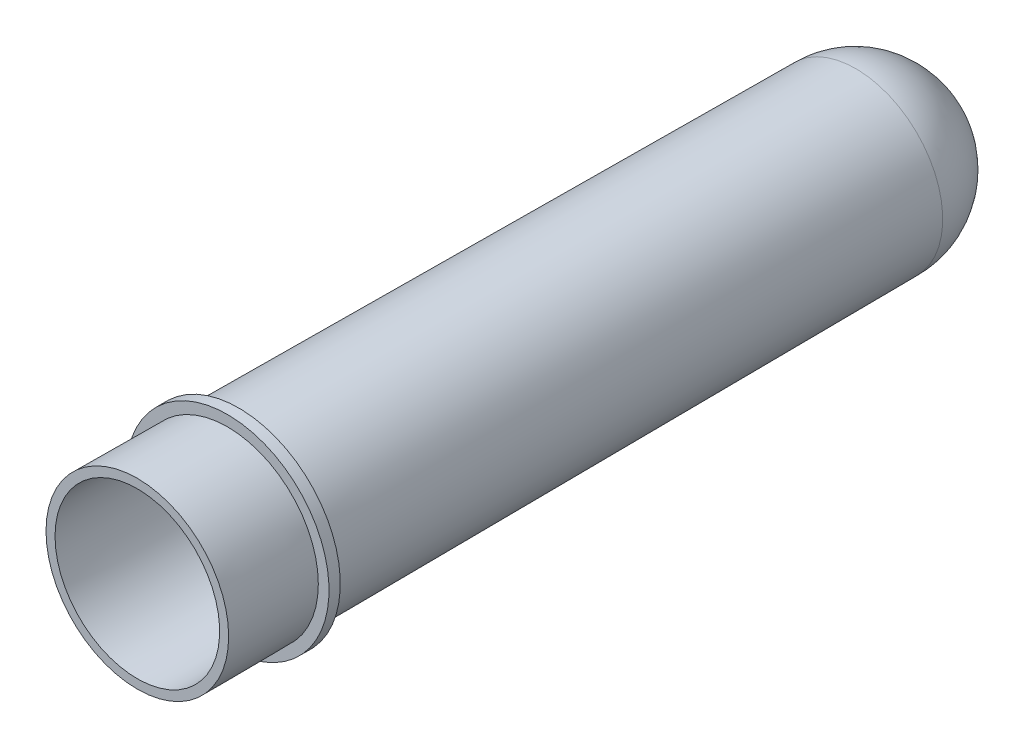
ISO-10303-21;
HEADER;
FILE_DESCRIPTION(('STEP AP214'),'2;1');
FILE_NAME('part.step','',(''),(''),'','','');
FILE_SCHEMA(('AUTOMOTIVE_DESIGN { 1 0 10303 214 1 1 1 1 }'));
ENDSEC;
DATA;
#1=APPLICATION_CONTEXT('core data for automotive mechanical design processes');
#2=APPLICATION_PROTOCOL_DEFINITION('international standard','automotive_design',2000,#1);
#3=PRODUCT_CONTEXT('',#1,'mechanical');
#4=PRODUCT('Part','Part','',(#3));
#5=PRODUCT_RELATED_PRODUCT_CATEGORY('part','',(#4));
#6=PRODUCT_DEFINITION_FORMATION('','',#4);
#7=PRODUCT_DEFINITION_CONTEXT('part definition',#1,'design');
#8=PRODUCT_DEFINITION('design','',#6,#7);
#9=PRODUCT_DEFINITION_SHAPE('','',#8);
#10=(LENGTH_UNIT() NAMED_UNIT(*) SI_UNIT(.MILLI.,.METRE.));
#11=(NAMED_UNIT(*) PLANE_ANGLE_UNIT() SI_UNIT($,.RADIAN.));
#12=(NAMED_UNIT(*) SI_UNIT($,.STERADIAN.) SOLID_ANGLE_UNIT());
#13=UNCERTAINTY_MEASURE_WITH_UNIT(LENGTH_MEASURE(1.E-05),#10,'distance_accuracy_value','');
#14=(GEOMETRIC_REPRESENTATION_CONTEXT(3) GLOBAL_UNCERTAINTY_ASSIGNED_CONTEXT((#13)) GLOBAL_UNIT_ASSIGNED_CONTEXT((#10,
#11,#12)) REPRESENTATION_CONTEXT('',''));
#15=CARTESIAN_POINT('',(0.,0.,0.));
#16=DIRECTION('',(0.,0.,1.));
#17=DIRECTION('',(1.,0.,0.));
#18=AXIS2_PLACEMENT_3D('',#15,#16,#17);
#19=CARTESIAN_POINT('',(0.,0.,107.));
#20=DIRECTION('',(0.,0.,1.));
#21=DIRECTION('',(1.,0.,0.));
#22=AXIS2_PLACEMENT_3D('',#19,#20,#21);
#23=PLANE('',#22);
#24=CARTESIAN_POINT('',(0.,0.,107.));
#25=DIRECTION('',(0.,0.,-1.));
#26=DIRECTION('',(1.,0.,0.));
#27=AXIS2_PLACEMENT_3D('',#24,#25,#26);
#28=CIRCLE('',#27,10.9499778585325);
#29=CARTESIAN_POINT('',(-10.9499778585325,0.,107.));
#30=VERTEX_POINT('',#29);
#31=EDGE_CURVE('E68',#30,#30,#28,.T.);
#32=ORIENTED_EDGE('',*,*,#31,.T.);
#33=EDGE_LOOP('',(#32));
#34=FACE_BOUND('',#33,.T.);
#35=CARTESIAN_POINT('',(0.,0.,107.));
#36=DIRECTION('',(0.,0.,1.));
#37=DIRECTION('',(1.,0.,0.));
#38=AXIS2_PLACEMENT_3D('',#35,#36,#37);
#39=CIRCLE('',#38,12.15);
#40=CARTESIAN_POINT('',(-12.15,0.,107.));
#41=VERTEX_POINT('',#40);
#42=EDGE_CURVE('E27',#41,#41,#39,.T.);
#43=ORIENTED_EDGE('',*,*,#42,.T.);
#44=EDGE_LOOP('',(#43));
#45=FACE_BOUND('',#44,.T.);
#46=ADVANCED_FACE('F16',(#34,#45),#23,.T.);
#47=CARTESIAN_POINT('',(0.,0.,0.));
#48=DIRECTION('',(0.,0.,1.));
#49=DIRECTION('',(1.,0.,0.));
#50=AXIS2_PLACEMENT_3D('',#47,#48,#49);
#51=PLANE('',#50);
#52=CARTESIAN_POINT('',(0.,0.,0.));
#53=DIRECTION('',(0.,0.,1.));
#54=DIRECTION('',(1.,0.,0.));
#55=AXIS2_PLACEMENT_3D('',#52,#53,#54);
#56=CIRCLE('',#55,0.0696476240206367);
#57=CARTESIAN_POINT('',(-0.0696476240206367,0.,0.));
#58=VERTEX_POINT('',#57);
#59=EDGE_CURVE('E93',#58,#58,#56,.T.);
#60=ORIENTED_EDGE('',*,*,#59,.F.);
#61=EDGE_LOOP('',(#60));
#62=FACE_BOUND('',#61,.T.);
#63=ADVANCED_FACE('F168',(#62),#51,.F.);
#64=CARTESIAN_POINT('',(0.,0.,53.5));
#65=DIRECTION('',(0.,0.,1.));
#66=DIRECTION('',(1.,0.,0.));
#67=AXIS2_PLACEMENT_3D('',#64,#65,#66);
#68=CONICAL_SURFACE('',#67,11.825,0.00607469163153367);
#69=ORIENTED_EDGE('',*,*,#42,.F.);
#70=DIRECTION('',(0.00607465427034013,0.,-0.99998154911753));
#71=VECTOR('',#70,1.);
#72=CARTESIAN_POINT('',(-11.825,0.,53.5));
#73=LINE('',#72,#71);
#74=CARTESIAN_POINT('',(-12.0771028037383,0.,95.));
#75=VERTEX_POINT('',#74);
#76=EDGE_CURVE('E11',#41,#75,#73,.T.);
#77=ORIENTED_EDGE('',*,*,#76,.T.);
#78=CARTESIAN_POINT('',(0.,0.,95.));
#79=DIRECTION('',(0.,0.,1.));
#80=DIRECTION('',(1.,0.,0.));
#81=AXIS2_PLACEMENT_3D('',#78,#79,#80);
#82=CIRCLE('',#81,12.0771028037383);
#83=EDGE_CURVE('E127',#75,#75,#82,.T.);
#84=ORIENTED_EDGE('',*,*,#83,.T.);
#85=ORIENTED_EDGE('',*,*,#76,.F.);
#86=EDGE_LOOP('',(#69,#77,#84,#85));
#87=FACE_BOUND('',#86,.T.);
#88=ADVANCED_FACE('F18',(#87),#68,.T.);
#89=CARTESIAN_POINT('',(-0.0696476240206374,0.,0.));
#90=CARTESIAN_POINT('',(-0.0696476240206374,-0.0696476240206374,0.));
#91=CARTESIAN_POINT('',(0.,-0.0696476240206374,0.));
#92=CARTESIAN_POINT('',(0.0696476240206374,-0.0696476240206374,0.));
#93=CARTESIAN_POINT('',(0.0696476240206374,0.,0.));
#94=CARTESIAN_POINT('',(0.0696476240206374,0.0696476240206374,0.));
#95=CARTESIAN_POINT('',(0.,0.0696476240206374,0.));
#96=CARTESIAN_POINT('',(-0.0696476240206374,0.0696476240206374,0.));
#97=CARTESIAN_POINT('',(-0.0696476240206374,0.,0.));
#98=CARTESIAN_POINT('',(-11.5,0.,0.));
#99=CARTESIAN_POINT('',(-11.5,-11.5,0.));
#100=CARTESIAN_POINT('',(0.,-11.5,0.));
#101=CARTESIAN_POINT('',(11.5,-11.5,0.));
#102=CARTESIAN_POINT('',(11.5,0.,0.));
#103=CARTESIAN_POINT('',(11.5,11.5,0.));
#104=CARTESIAN_POINT('',(0.,11.5,0.));
#105=CARTESIAN_POINT('',(-11.5,11.5,0.));
#106=CARTESIAN_POINT('',(-11.5,0.,0.));
#107=CARTESIAN_POINT('',(-11.5694354388722,0.,11.4301414758912));
#108=CARTESIAN_POINT('',(-11.5694354388722,-11.5694354388722,11.4301414758912));
#109=CARTESIAN_POINT('',(0.,-11.5694354388722,11.4301414758912));
#110=CARTESIAN_POINT('',(11.5694354388722,-11.5694354388722,11.4301414758912));
#111=CARTESIAN_POINT('',(11.5694354388722,0.,11.4301414758912));
#112=CARTESIAN_POINT('',(11.5694354388722,11.5694354388722,11.4301414758912));
#113=CARTESIAN_POINT('',(0.,11.5694354388722,11.4301414758912));
#114=CARTESIAN_POINT('',(-11.5694354388722,11.5694354388722,11.4301414758912));
#115=CARTESIAN_POINT('',(-11.5694354388722,0.,11.4301414758912));
#116=(BOUNDED_SURFACE() B_SPLINE_SURFACE(2,2,((#89,#90,#91,#92,#93,#94,#95,#96,#97),(#98,#99,
#100,#101,#102,#103,#104,#105,#106),(#107,#108,#109,#110,#111,#112,#113,#114,#115)),
.UNSPECIFIED.,.F.,.T.,.F.) B_SPLINE_SURFACE_WITH_KNOTS((3,3),(3,2,2,2,3),(-1.5707963267949,
-0.00607469163152602),(-3.14159265358979,-1.5707963267949,0.,1.5707963267949,3.14159265358979),
.UNSPECIFIED.) GEOMETRIC_REPRESENTATION_ITEM() RATIONAL_B_SPLINE_SURFACE(((1.,0.707106781186548,
1.,0.707106781186548,1.,0.707106781186548,1.,0.707106781186548,1.),(0.709251244013833,
0.501516364207176,0.709251244013833,0.501516364207176,0.709251244013833,0.501516364207176,
0.709251244013833,0.501516364207176,0.709251244013833),(1.,0.707106781186548,1.,
0.707106781186548,1.,0.707106781186548,1.,0.707106781186548,1.))) REPRESENTATION_ITEM('') SURFACE());
#117=CARTESIAN_POINT('',(0.,0.,11.4301414758912));
#118=DIRECTION('',(0.,0.,-1.));
#119=DIRECTION('',(1.,0.,0.));
#120=AXIS2_PLACEMENT_3D('',#117,#118,#119);
#121=CIRCLE('',#120,11.5694354388722);
#122=CARTESIAN_POINT('',(-11.5694354388722,0.,11.4301414758912));
#123=VERTEX_POINT('',#122);
#124=EDGE_CURVE('E91',#123,#123,#121,.T.);
#125=CARTESIAN_POINT('',(-0.0696476240206367,0.,11.5));
#126=DIRECTION('',(0.,-1.,0.));
#127=DIRECTION('',(-1.,0.,0.));
#128=AXIS2_PLACEMENT_3D('',#125,#126,#127);
#129=CIRCLE('',#128,11.5);
#130=EDGE_CURVE('E89',#123,#58,#129,.T.);
#131=ORIENTED_EDGE('',*,*,#124,.T.);
#132=ORIENTED_EDGE('',*,*,#130,.T.);
#133=ORIENTED_EDGE('',*,*,#59,.T.);
#134=ORIENTED_EDGE('',*,*,#130,.F.);
#135=EDGE_LOOP('',(#131,#132,#133,#134));
#136=FACE_BOUND('',#135,.T.);
#137=ADVANCED_FACE('F90',(#136),#116,.F.);
#138=CARTESIAN_POINT('',(0.,0.,53.5));
#139=DIRECTION('',(0.,0.,1.));
#140=DIRECTION('',(1.,0.,0.));
#141=AXIS2_PLACEMENT_3D('',#138,#139,#140);
#142=CONICAL_SURFACE('',#141,11.825,0.00607469163153367);
#143=CARTESIAN_POINT('',(0.,0.,93.5));
#144=DIRECTION('',(0.,0.,-1.));
#145=DIRECTION('',(1.,0.,0.));
#146=AXIS2_PLACEMENT_3D('',#143,#144,#145);
#147=CIRCLE('',#146,12.0679906542056);
#148=CARTESIAN_POINT('',(-12.0679906542056,0.,93.5));
#149=VERTEX_POINT('',#148);
#150=EDGE_CURVE('E105',#149,#149,#147,.T.);
#151=ORIENTED_EDGE('',*,*,#150,.T.);
#152=DIRECTION('',(0.00607465427034013,0.,-0.99998154911753));
#153=VECTOR('',#152,1.);
#154=CARTESIAN_POINT('',(-11.825,0.,53.5));
#155=LINE('',#154,#153);
#156=EDGE_CURVE('E82',#149,#123,#155,.T.);
#157=ORIENTED_EDGE('',*,*,#156,.T.);
#158=ORIENTED_EDGE('',*,*,#124,.F.);
#159=ORIENTED_EDGE('',*,*,#156,.F.);
#160=EDGE_LOOP('',(#151,#157,#158,#159));
#161=FACE_BOUND('',#160,.T.);
#162=ADVANCED_FACE('F198',(#161),#142,.T.);
#163=CARTESIAN_POINT('',(0.,0.,95.));
#164=DIRECTION('',(0.,0.,-1.));
#165=DIRECTION('',(1.,0.,0.));
#166=AXIS2_PLACEMENT_3D('',#163,#164,#165);
#167=CYLINDRICAL_SURFACE('',#166,13.5);
#168=CARTESIAN_POINT('',(0.,0.,93.5));
#169=DIRECTION('',(0.,0.,-1.));
#170=DIRECTION('',(1.,0.,0.));
#171=AXIS2_PLACEMENT_3D('',#168,#169,#170);
#172=CIRCLE('',#171,13.5);
#173=CARTESIAN_POINT('',(-13.5,0.,93.5));
#174=VERTEX_POINT('',#173);
#175=EDGE_CURVE('E124',#174,#174,#172,.T.);
#176=ORIENTED_EDGE('',*,*,#175,.F.);
#177=DIRECTION('',(0.,0.,1.));
#178=VECTOR('',#177,1.);
#179=CARTESIAN_POINT('',(-13.5,0.,95.));
#180=LINE('',#179,#178);
#181=CARTESIAN_POINT('',(-13.5,0.,95.));
#182=VERTEX_POINT('',#181);
#183=EDGE_CURVE('E111',#174,#182,#180,.T.);
#184=ORIENTED_EDGE('',*,*,#183,.T.);
#185=CARTESIAN_POINT('',(0.,0.,95.));
#186=DIRECTION('',(0.,0.,1.));
#187=DIRECTION('',(1.,0.,0.));
#188=AXIS2_PLACEMENT_3D('',#185,#186,#187);
#189=CIRCLE('',#188,13.5);
#190=EDGE_CURVE('E143',#182,#182,#189,.T.);
#191=ORIENTED_EDGE('',*,*,#190,.F.);
#192=ORIENTED_EDGE('',*,*,#183,.F.);
#193=EDGE_LOOP('',(#176,#184,#191,#192));
#194=FACE_BOUND('',#193,.T.);
#195=ADVANCED_FACE('F158',(#194),#167,.T.);
#196=CARTESIAN_POINT('',(0.,0.,93.5));
#197=DIRECTION('',(0.,0.,1.));
#198=DIRECTION('',(1.,0.,0.));
#199=AXIS2_PLACEMENT_3D('',#196,#197,#198);
#200=PLANE('',#199);
#201=ORIENTED_EDGE('',*,*,#150,.F.);
#202=EDGE_LOOP('',(#201));
#203=FACE_BOUND('',#202,.T.);
#204=ORIENTED_EDGE('',*,*,#175,.T.);
#205=EDGE_LOOP('',(#204));
#206=FACE_BOUND('',#205,.T.);
#207=ADVANCED_FACE('F157',(#203,#206),#200,.F.);
#208=CARTESIAN_POINT('',(0.,0.,95.));
#209=DIRECTION('',(0.,0.,1.));
#210=DIRECTION('',(1.,0.,0.));
#211=AXIS2_PLACEMENT_3D('',#208,#209,#210);
#212=PLANE('',#211);
#213=ORIENTED_EDGE('',*,*,#83,.F.);
#214=EDGE_LOOP('',(#213));
#215=FACE_BOUND('',#214,.T.);
#216=ORIENTED_EDGE('',*,*,#190,.T.);
#217=EDGE_LOOP('',(#216));
#218=FACE_BOUND('',#217,.T.);
#219=ADVANCED_FACE('F239',(#215,#218),#212,.T.);
#220=CARTESIAN_POINT('',(0.,0.,1.2));
#221=DIRECTION('',(0.,0.,1.));
#222=DIRECTION('',(1.,0.,0.));
#223=AXIS2_PLACEMENT_3D('',#220,#221,#222);
#224=PLANE('',#223);
#225=CARTESIAN_POINT('',(0.,0.,1.2));
#226=DIRECTION('',(0.,0.,1.));
#227=DIRECTION('',(1.,0.,0.));
#228=AXIS2_PLACEMENT_3D('',#225,#226,#227);
#229=CIRCLE('',#228,0.0696476240206367);
#230=CARTESIAN_POINT('',(-0.0696476240206367,0.,1.2));
#231=VERTEX_POINT('',#230);
#232=EDGE_CURVE('E108',#231,#231,#229,.T.);
#233=ORIENTED_EDGE('',*,*,#232,.T.);
#234=EDGE_LOOP('',(#233));
#235=FACE_BOUND('',#234,.T.);
#236=ADVANCED_FACE('F182',(#235),#224,.T.);
#237=CARTESIAN_POINT('',(-0.0696476240206374,0.,1.20000000000005));
#238=CARTESIAN_POINT('',(-0.0696476240206374,-0.0696476240206374,1.20000000000005));
#239=CARTESIAN_POINT('',(0.,-0.0696476240206374,1.20000000000005));
#240=CARTESIAN_POINT('',(0.0696476240206374,-0.0696476240206374,1.20000000000005));
#241=CARTESIAN_POINT('',(0.0696476240206374,0.,1.20000000000005));
#242=CARTESIAN_POINT('',(0.0696476240206374,0.0696476240206374,1.20000000000005));
#243=CARTESIAN_POINT('',(0.,0.0696476240206374,1.20000000000005));
#244=CARTESIAN_POINT('',(-0.0696476240206374,0.0696476240206374,1.20000000000005));
#245=CARTESIAN_POINT('',(-0.0696476240206374,0.,1.20000000000005));
#246=CARTESIAN_POINT('',(-10.3072675781587,0.,1.20000000000006));
#247=CARTESIAN_POINT('',(-10.3072675781587,-10.3072675781587,1.20000000000006));
#248=CARTESIAN_POINT('',(0.,-10.3072675781587,1.20000000000005));
#249=CARTESIAN_POINT('',(10.3072675781587,-10.3072675781587,1.20000000000005));
#250=CARTESIAN_POINT('',(10.3072675781587,0.,1.20000000000005));
#251=CARTESIAN_POINT('',(10.3072675781587,10.3072675781587,1.20000000000005));
#252=CARTESIAN_POINT('',(0.,10.3072675781587,1.20000000000005));
#253=CARTESIAN_POINT('',(-10.3072675781587,10.3072675781587,1.20000000000006));
#254=CARTESIAN_POINT('',(-10.3072675781587,0.,1.20000000000006));
#255=CARTESIAN_POINT('',(-10.3694575799312,0.,11.4374310610156));
#256=CARTESIAN_POINT('',(-10.3694575799312,-10.3694575799312,11.4374310610156));
#257=CARTESIAN_POINT('',(0.,-10.3694575799312,11.4374310610156));
#258=CARTESIAN_POINT('',(10.3694575799312,-10.3694575799312,11.4374310610156));
#259=CARTESIAN_POINT('',(10.3694575799312,0.,11.4374310610156));
#260=CARTESIAN_POINT('',(10.3694575799312,10.3694575799312,11.4374310610156));
#261=CARTESIAN_POINT('',(0.,10.3694575799312,11.4374310610156));
#262=CARTESIAN_POINT('',(-10.3694575799312,10.3694575799312,11.4374310610156));
#263=CARTESIAN_POINT('',(-10.3694575799312,0.,11.4374310610156));
#264=(BOUNDED_SURFACE() B_SPLINE_SURFACE(2,2,((#237,#238,#239,#240,#241,#242,#243,#244,#245),
(#246,#247,#248,#249,#250,#251,#252,#253,#254),(#255,#256,#257,#258,#259,#260,#261,#262,#263)),
.UNSPECIFIED.,.F.,.T.,.F.) B_SPLINE_SURFACE_WITH_KNOTS((3,3),(3,2,2,2,3),(-1.5707963267949,
-0.00607469163152596),(-3.14159265358979,-1.5707963267949,0.,1.5707963267949,3.14159265358979),
.UNSPECIFIED.) GEOMETRIC_REPRESENTATION_ITEM() RATIONAL_B_SPLINE_SURFACE(((1.,0.707106781186548,
1.,0.707106781186548,1.,0.707106781186548,1.,0.707106781186548,1.),(0.709251244013833,
0.501516364207176,0.709251244013833,0.501516364207176,0.709251244013833,0.501516364207176,
0.709251244013833,0.501516364207176,0.709251244013833),(1.,0.707106781186548,1.,
0.707106781186548,1.,0.707106781186548,1.,0.707106781186548,1.))) REPRESENTATION_ITEM('') SURFACE());
#265=CARTESIAN_POINT('',(-0.0696476240206367,0.,11.5));
#266=DIRECTION('',(0.,1.,0.));
#267=DIRECTION('',(-1.,0.,0.));
#268=AXIS2_PLACEMENT_3D('',#265,#266,#267);
#269=CIRCLE('',#268,10.3);
#270=CARTESIAN_POINT('',(-10.3694575799312,0.,11.4374310610156));
#271=VERTEX_POINT('',#270);
#272=EDGE_CURVE('E20',#231,#271,#269,.T.);
#273=CARTESIAN_POINT('',(0.,0.,11.4374310610156));
#274=DIRECTION('',(0.,0.,-1.));
#275=DIRECTION('',(1.,0.,0.));
#276=AXIS2_PLACEMENT_3D('',#273,#274,#275);
#277=CIRCLE('',#276,10.3694575799312);
#278=EDGE_CURVE('E132',#271,#271,#277,.T.);
#279=ORIENTED_EDGE('',*,*,#232,.F.);
#280=ORIENTED_EDGE('',*,*,#272,.T.);
#281=ORIENTED_EDGE('',*,*,#278,.F.);
#282=ORIENTED_EDGE('',*,*,#272,.F.);
#283=EDGE_LOOP('',(#279,#280,#281,#282));
#284=FACE_BOUND('',#283,.T.);
#285=ADVANCED_FACE('F176',(#284),#264,.T.);
#286=CARTESIAN_POINT('',(0.,0.,53.5072895851244));
#287=DIRECTION('',(0.,0.,1.));
#288=DIRECTION('',(1.,0.,0.));
#289=AXIS2_PLACEMENT_3D('',#286,#287,#288);
#290=CONICAL_SURFACE('',#289,10.625022141059,0.00607469163153367);
#291=ORIENTED_EDGE('',*,*,#278,.T.);
#292=DIRECTION('',(-0.00607465427034013,0.,0.99998154911753));
#293=VECTOR('',#292,1.);
#294=CARTESIAN_POINT('',(-10.625022141059,0.,53.5072895851244));
#295=LINE('',#294,#293);
#296=EDGE_CURVE('E109',#271,#30,#295,.T.);
#297=ORIENTED_EDGE('',*,*,#296,.T.);
#298=ORIENTED_EDGE('',*,*,#31,.F.);
#299=ORIENTED_EDGE('',*,*,#296,.F.);
#300=EDGE_LOOP('',(#291,#297,#298,#299));
#301=FACE_BOUND('',#300,.T.);
#302=ADVANCED_FACE('F181',(#301),#290,.F.);
#303=CLOSED_SHELL('',(#46,#63,#88,#137,#162,#195,#207,#219,#236,#285,#302));
#304=MANIFOLD_SOLID_BREP('B1',#303);
#305=ADVANCED_BREP_SHAPE_REPRESENTATION('',(#18,#304),#14);
#306=SHAPE_DEFINITION_REPRESENTATION(#9,#305);
ENDSEC;
END-ISO-10303-21;
